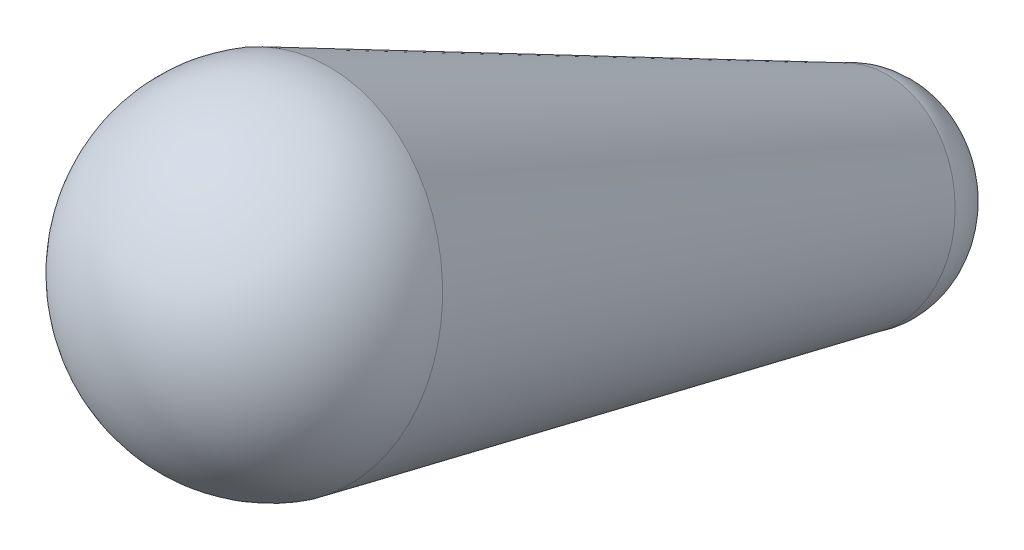
ISO-10303-21;
HEADER;
FILE_DESCRIPTION(('STEP AP214'),'2;1');
FILE_NAME('part.step','',(''),(''),'','','');
FILE_SCHEMA(('AUTOMOTIVE_DESIGN { 1 0 10303 214 1 1 1 1 }'));
ENDSEC;
DATA;
#1=APPLICATION_CONTEXT('core data for automotive mechanical design processes');
#2=APPLICATION_PROTOCOL_DEFINITION('international standard','automotive_design',2000,#1);
#3=PRODUCT_CONTEXT('',#1,'mechanical');
#4=PRODUCT('Part','Part','',(#3));
#5=PRODUCT_RELATED_PRODUCT_CATEGORY('part','',(#4));
#6=PRODUCT_DEFINITION_FORMATION('','',#4);
#7=PRODUCT_DEFINITION_CONTEXT('part definition',#1,'design');
#8=PRODUCT_DEFINITION('design','',#6,#7);
#9=PRODUCT_DEFINITION_SHAPE('','',#8);
#10=(LENGTH_UNIT() NAMED_UNIT(*) SI_UNIT(.MILLI.,.METRE.));
#11=(NAMED_UNIT(*) PLANE_ANGLE_UNIT() SI_UNIT($,.RADIAN.));
#12=(NAMED_UNIT(*) SI_UNIT($,.STERADIAN.) SOLID_ANGLE_UNIT());
#13=UNCERTAINTY_MEASURE_WITH_UNIT(LENGTH_MEASURE(1.E-05),#10,'distance_accuracy_value','');
#14=(GEOMETRIC_REPRESENTATION_CONTEXT(3) GLOBAL_UNCERTAINTY_ASSIGNED_CONTEXT((#13)) GLOBAL_UNIT_ASSIGNED_CONTEXT((#10,
#11,#12)) REPRESENTATION_CONTEXT('',''));
#15=CARTESIAN_POINT('',(0.,0.,0.));
#16=DIRECTION('',(0.,0.,1.));
#17=DIRECTION('',(1.,0.,0.));
#18=AXIS2_PLACEMENT_3D('',#15,#16,#17);
#19=CARTESIAN_POINT('',(0.,-51.695936182814,-189.321050654897));
#20=DIRECTION('',(0.,0.360498667668961,0.932759728230643));
#21=DIRECTION('',(0.,0.932759728230643,-0.360498667668961));
#22=AXIS2_PLACEMENT_3D('',#19,#20,#21);
#23=CONICAL_SURFACE('',#22,6.26889858688982,0.10471975511966);
#24=CARTESIAN_POINT('',(0.,-60.4148478644822,-211.880495168927));
#25=DIRECTION('',(0.,-0.360498667668961,-0.932759728230643));
#26=DIRECTION('',(0.,0.932759728230643,-0.360498667668961));
#27=AXIS2_PLACEMENT_3D('',#24,#25,#26);
#28=CIRCLE('',#27,3.72687935953386);
#29=CARTESIAN_POINT('',(0.,-56.938564885935,-213.224030212602));
#30=VERTEX_POINT('',#29);
#31=EDGE_CURVE('E11',#30,#30,#28,.T.);
#32=ORIENTED_EDGE('',*,*,#31,.F.);
#33=EDGE_LOOP('',(#32));
#34=FACE_BOUND('',#33,.T.);
#35=CARTESIAN_POINT('',(0.,-51.695936182814,-189.321050654897));
#36=DIRECTION('',(0.,-0.360498667668961,-0.932759728230643));
#37=DIRECTION('',(0.,0.932759728230643,-0.360498667668961));
#38=AXIS2_PLACEMENT_3D('',#35,#36,#37);
#39=CIRCLE('',#38,6.26889858688982);
#40=CARTESIAN_POINT('',(0.,-45.8485600406012,-191.580980243222));
#41=VERTEX_POINT('',#40);
#42=EDGE_CURVE('E45',#41,#41,#39,.T.);
#43=ORIENTED_EDGE('',*,*,#42,.T.);
#44=EDGE_LOOP('',(#43));
#45=FACE_BOUND('',#44,.T.);
#46=ADVANCED_FACE('F36',(#34,#45),#23,.T.);
#47=CARTESIAN_POINT('',(0.,-60.4148478644822,-211.880495168927));
#48=DIRECTION('',(1.,0.,0.));
#49=DIRECTION('',(0.,0.932759728230644,-0.360498667668961));
#50=AXIS2_PLACEMENT_3D('',#47,#48,#49);
#51=ELLIPSE('',#50,3.72687935953386,3.00000000000001);
#52=TRIMMED_CURVE('',#51,(PARAMETER_VALUE(4.71238898038469)),
(PARAMETER_VALUE(7.85398163397448)),.T.,.PARAMETER.);
#53=CARTESIAN_POINT('',(0.,-59.3333518614753,-209.082215984235));
#54=DIRECTION('',(0.,-0.360498667668961,-0.932759728230644));
#55=AXIS1_PLACEMENT('',#53,#54);
#56=SURFACE_OF_REVOLUTION('',#52,#55);
#57=CARTESIAN_POINT('',(0.,-61.4963438674891,-214.678774353619));
#58=VERTEX_POINT('',#57);
#59=VERTEX_LOOP('',#58);
#60=FACE_BOUND('',#59,.T.);
#61=ORIENTED_EDGE('',*,*,#31,.T.);
#62=EDGE_LOOP('',(#61));
#63=FACE_BOUND('',#62,.T.);
#64=ADVANCED_FACE('F38',(#60,#63),#56,.F.);
#65=CARTESIAN_POINT('',(0.,-51.695936182814,-189.321050654897));
#66=DIRECTION('',(-1.,0.,0.));
#67=DIRECTION('',(0.,0.932759728230644,-0.36049866766896));
#68=AXIS2_PLACEMENT_3D('',#65,#66,#67);
#69=ELLIPSE('',#68,6.26889858688982,6.);
#70=TRIMMED_CURVE('',#69,(PARAMETER_VALUE(4.71238898038469)),
(PARAMETER_VALUE(7.85398163397448)),.T.,.PARAMETER.);
#71=CARTESIAN_POINT('',(0.,-53.8589281888278,-194.91760902428));
#72=DIRECTION('',(0.,0.360498667668961,0.932759728230643));
#73=AXIS1_PLACEMENT('',#71,#72);
#74=SURFACE_OF_REVOLUTION('',#70,#73);
#75=CARTESIAN_POINT('',(0.,-49.5329441768002,-183.724492285513));
#76=VERTEX_POINT('',#75);
#77=VERTEX_LOOP('',#76);
#78=FACE_BOUND('',#77,.T.);
#79=ORIENTED_EDGE('',*,*,#42,.F.);
#80=EDGE_LOOP('',(#79));
#81=FACE_BOUND('',#80,.T.);
#82=ADVANCED_FACE('F51',(#78,#81),#74,.F.);
#83=CLOSED_SHELL('',(#46,#64,#82));
#84=MANIFOLD_SOLID_BREP('B2',#83);
#85=ADVANCED_BREP_SHAPE_REPRESENTATION('',(#18,#84),#14);
#86=SHAPE_DEFINITION_REPRESENTATION(#9,#85);
ENDSEC;
END-ISO-10303-21;
